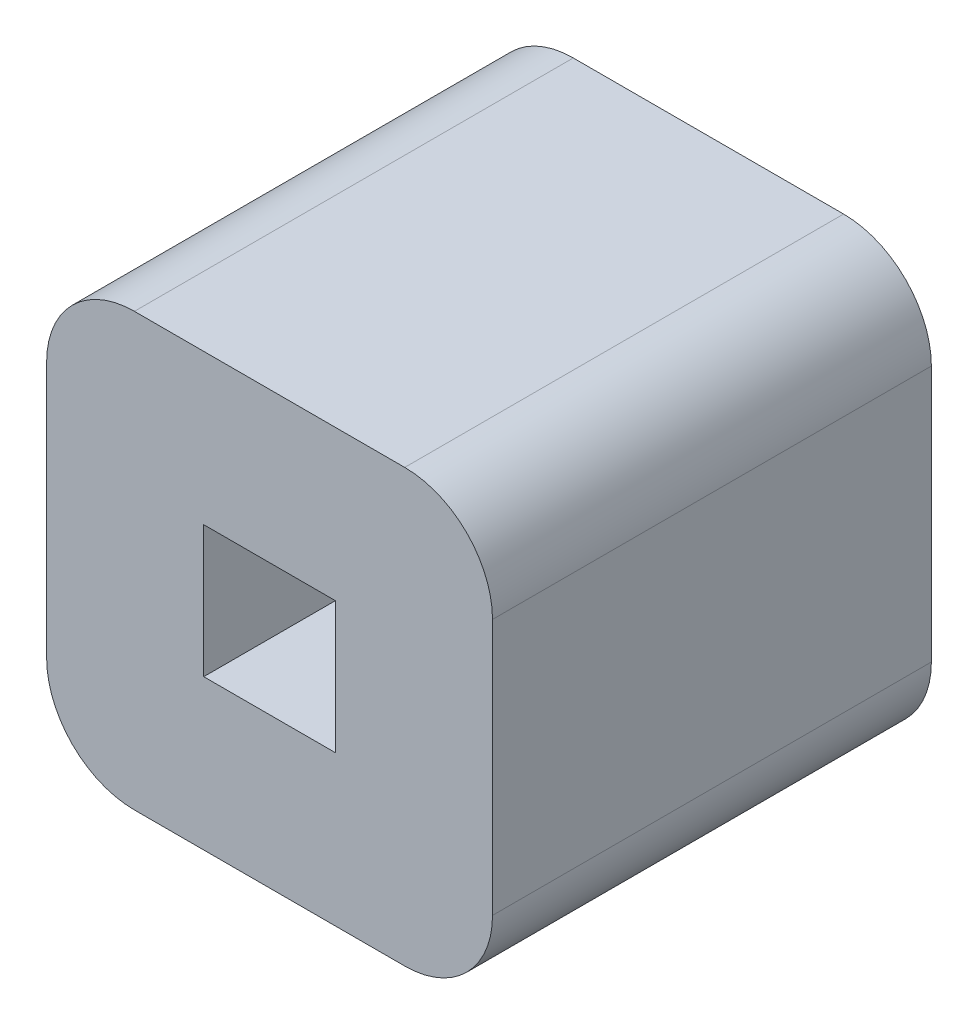
ISO-10303-21;
HEADER;
FILE_DESCRIPTION(('STEP AP214'),'2;1');
FILE_NAME('part.step','',(''),(''),'','','');
FILE_SCHEMA(('AUTOMOTIVE_DESIGN { 1 0 10303 214 1 1 1 1 }'));
ENDSEC;
DATA;
#1=APPLICATION_CONTEXT('core data for automotive mechanical design processes');
#2=APPLICATION_PROTOCOL_DEFINITION('international standard','automotive_design',2000,#1);
#3=PRODUCT_CONTEXT('',#1,'mechanical');
#4=PRODUCT('Part','Part','',(#3));
#5=PRODUCT_RELATED_PRODUCT_CATEGORY('part','',(#4));
#6=PRODUCT_DEFINITION_FORMATION('','',#4);
#7=PRODUCT_DEFINITION_CONTEXT('part definition',#1,'design');
#8=PRODUCT_DEFINITION('design','',#6,#7);
#9=PRODUCT_DEFINITION_SHAPE('','',#8);
#10=(LENGTH_UNIT() NAMED_UNIT(*) SI_UNIT(.MILLI.,.METRE.));
#11=(NAMED_UNIT(*) PLANE_ANGLE_UNIT() SI_UNIT($,.RADIAN.));
#12=(NAMED_UNIT(*) SI_UNIT($,.STERADIAN.) SOLID_ANGLE_UNIT());
#13=UNCERTAINTY_MEASURE_WITH_UNIT(LENGTH_MEASURE(1.E-05),#10,'distance_accuracy_value','');
#14=(GEOMETRIC_REPRESENTATION_CONTEXT(3) GLOBAL_UNCERTAINTY_ASSIGNED_CONTEXT((#13)) GLOBAL_UNIT_ASSIGNED_CONTEXT((#10,
#11,#12)) REPRESENTATION_CONTEXT('',''));
#15=CARTESIAN_POINT('',(0.,0.,0.));
#16=DIRECTION('',(0.,0.,1.));
#17=DIRECTION('',(1.,0.,0.));
#18=AXIS2_PLACEMENT_3D('',#15,#16,#17);
#19=CARTESIAN_POINT('',(0.960735714690616,-1.07588735959036,0.16337874015748));
#20=DIRECTION('',(0.,0.,1.));
#21=DIRECTION('',(0.,-1.,0.));
#22=AXIS2_PLACEMENT_3D('',#19,#20,#21);
#23=PLANE('',#22);
#24=DIRECTION('',(1.,0.,0.));
#25=VECTOR('',#24,1.);
#26=CARTESIAN_POINT('',(1.0823892579977,-0.869194446204529,0.16337874015748));
#27=LINE('',#26,#25);
#28=CARTESIAN_POINT('',(1.14605067532054,-0.869194446204529,0.16337874015748));
#29=VERTEX_POINT('',#28);
#30=CARTESIAN_POINT('',(1.08542075406069,-0.869194446204529,0.16337874015748));
#31=VERTEX_POINT('',#30);
#32=EDGE_CURVE('E131',#29,#31,#27,.F.);
#33=ORIENTED_EDGE('',*,*,#32,.T.);
#34=CARTESIAN_POINT('',(1.08542075406069,-0.888879485574608,0.16337874015748));
#35=DIRECTION('',(0.,0.,1.));
#36=DIRECTION('',(0.,-1.,0.));
#37=AXIS2_PLACEMENT_3D('',#34,#35,#36);
#38=CIRCLE('',#37,0.0196850393700787);
#39=CARTESIAN_POINT('',(1.06573571469062,-0.888879485574608,0.16337874015748));
#40=VERTEX_POINT('',#39);
#41=EDGE_CURVE('E134',#40,#31,#38,.F.);
#42=ORIENTED_EDGE('',*,*,#41,.F.);
#43=DIRECTION('',(0.,-1.,0.));
#44=VECTOR('',#43,1.);
#45=CARTESIAN_POINT('',(1.06573571469062,-0.917619643054922,0.16337874015748));
#46=LINE('',#45,#44);
#47=CARTESIAN_POINT('',(1.06573571469062,-0.946359800535237,0.16337874015748));
#48=VERTEX_POINT('',#47);
#49=EDGE_CURVE('E128',#48,#40,#46,.F.);
#50=ORIENTED_EDGE('',*,*,#49,.F.);
#51=CARTESIAN_POINT('',(1.08542075406069,-0.946359800535237,0.16337874015748));
#52=DIRECTION('',(0.,0.,-1.));
#53=DIRECTION('',(0.,1.,0.));
#54=AXIS2_PLACEMENT_3D('',#51,#52,#53);
#55=CIRCLE('',#54,0.0196850393700787);
#56=CARTESIAN_POINT('',(1.08542075406069,-0.966044839905316,0.16337874015748));
#57=VERTEX_POINT('',#56);
#58=EDGE_CURVE('E20',#57,#48,#55,.T.);
#59=ORIENTED_EDGE('',*,*,#58,.F.);
#60=DIRECTION('',(1.,0.,0.));
#61=VECTOR('',#60,1.);
#62=CARTESIAN_POINT('',(1.0823892579977,-0.966044839905316,0.16337874015748));
#63=LINE('',#62,#61);
#64=CARTESIAN_POINT('',(1.14605067532054,-0.966044839905316,0.16337874015748));
#65=VERTEX_POINT('',#64);
#66=EDGE_CURVE('E82',#65,#57,#63,.F.);
#67=ORIENTED_EDGE('',*,*,#66,.F.);
#68=CARTESIAN_POINT('',(1.14605067532054,-0.946359800535237,0.16337874015748));
#69=DIRECTION('',(0.,0.,-1.));
#70=DIRECTION('',(0.,1.,0.));
#71=AXIS2_PLACEMENT_3D('',#68,#69,#70);
#72=CIRCLE('',#71,0.0196850393700787);
#73=CARTESIAN_POINT('',(1.16573571469062,-0.946359800535237,0.16337874015748));
#74=VERTEX_POINT('',#73);
#75=EDGE_CURVE('E161',#74,#65,#72,.T.);
#76=ORIENTED_EDGE('',*,*,#75,.F.);
#77=DIRECTION('',(0.,-1.,0.));
#78=VECTOR('',#77,1.);
#79=CARTESIAN_POINT('',(1.16573571469062,-0.881005469826576,0.16337874015748));
#80=LINE('',#79,#78);
#81=CARTESIAN_POINT('',(1.16573571469062,-0.888879485574608,0.16337874015748));
#82=VERTEX_POINT('',#81);
#83=EDGE_CURVE('E136',#74,#82,#80,.F.);
#84=ORIENTED_EDGE('',*,*,#83,.T.);
#85=CARTESIAN_POINT('',(1.14605067532054,-0.888879485574608,0.16337874015748));
#86=DIRECTION('',(0.,0.,1.));
#87=DIRECTION('',(0.,-1.,0.));
#88=AXIS2_PLACEMENT_3D('',#85,#86,#87);
#89=CIRCLE('',#88,0.0196850393700787);
#90=EDGE_CURVE('E139',#29,#82,#89,.F.);
#91=ORIENTED_EDGE('',*,*,#90,.F.);
#92=EDGE_LOOP('',(#33,#42,#50,#59,#67,#76,#84,#91));
#93=FACE_BOUND('',#92,.T.);
#94=DIRECTION('',(1.,0.,0.));
#95=VECTOR('',#94,1.);
#96=CARTESIAN_POINT('',(1.13197587217093,-0.902855863527363,0.16337874015748));
#97=LINE('',#96,#95);
#98=CARTESIAN_POINT('',(1.10097193516306,-0.902855863527363,0.16337874015748));
#99=VERTEX_POINT('',#98);
#100=CARTESIAN_POINT('',(1.13049949421818,-0.902855863527363,0.16337874015748));
#101=VERTEX_POINT('',#100);
#102=EDGE_CURVE('E104',#99,#101,#97,.T.);
#103=ORIENTED_EDGE('',*,*,#102,.T.);
#104=DIRECTION('',(0.,1.,0.));
#105=VECTOR('',#104,1.);
#106=CARTESIAN_POINT('',(1.13049949421818,-0.933859800535237,0.16337874015748));
#107=LINE('',#106,#105);
#108=CARTESIAN_POINT('',(1.13049949421818,-0.932383422582481,0.16337874015748));
#109=VERTEX_POINT('',#108);
#110=EDGE_CURVE('E177',#101,#109,#107,.F.);
#111=ORIENTED_EDGE('',*,*,#110,.T.);
#112=DIRECTION('',(1.,0.,0.));
#113=VECTOR('',#112,1.);
#114=CARTESIAN_POINT('',(1.13197587217093,-0.932383422582481,0.16337874015748));
#115=LINE('',#114,#113);
#116=CARTESIAN_POINT('',(1.10097193516306,-0.932383422582481,0.16337874015748));
#117=VERTEX_POINT('',#116);
#118=EDGE_CURVE('E91',#117,#109,#115,.T.);
#119=ORIENTED_EDGE('',*,*,#118,.F.);
#120=DIRECTION('',(0.,-1.,0.));
#121=VECTOR('',#120,1.);
#122=CARTESIAN_POINT('',(1.10097193516306,-0.901379485574607,0.16337874015748));
#123=LINE('',#122,#121);
#124=EDGE_CURVE('E102',#117,#99,#123,.F.);
#125=ORIENTED_EDGE('',*,*,#124,.T.);
#126=EDGE_LOOP('',(#103,#111,#119,#125));
#127=FACE_BOUND('',#126,.T.);
#128=ADVANCED_FACE('F17',(#93,#127),#23,.T.);
#129=CARTESIAN_POINT('',(1.10097193516306,-0.901379485574607,0.152158267716535));
#130=DIRECTION('',(-1.,0.,0.));
#131=DIRECTION('',(0.,-1.,0.));
#132=AXIS2_PLACEMENT_3D('',#129,#130,#131);
#133=PLANE('',#132);
#134=DIRECTION('',(0.,0.,1.));
#135=VECTOR('',#134,1.);
#136=CARTESIAN_POINT('',(1.10097193516306,-0.932383422582481,0.152158267716535));
#137=LINE('',#136,#135);
#138=CARTESIAN_POINT('',(1.10097193516306,-0.932383422582481,0.0649535433070866));
#139=VERTEX_POINT('',#138);
#140=EDGE_CURVE('E172',#139,#117,#137,.T.);
#141=ORIENTED_EDGE('',*,*,#140,.F.);
#142=DIRECTION('',(0.,-1.,0.));
#143=VECTOR('',#142,1.);
#144=CARTESIAN_POINT('',(1.10097193516306,-1.07588735959036,0.0649535433070866));
#145=LINE('',#144,#143);
#146=CARTESIAN_POINT('',(1.10097193516306,-0.902855863527363,0.0649535433070866));
#147=VERTEX_POINT('',#146);
#148=EDGE_CURVE('E124',#139,#147,#145,.F.);
#149=ORIENTED_EDGE('',*,*,#148,.T.);
#150=DIRECTION('',(0.,0.,1.));
#151=VECTOR('',#150,1.);
#152=CARTESIAN_POINT('',(1.10097193516306,-0.902855863527363,0.152158267716535));
#153=LINE('',#152,#151);
#154=EDGE_CURVE('E109',#147,#99,#153,.T.);
#155=ORIENTED_EDGE('',*,*,#154,.T.);
#156=ORIENTED_EDGE('',*,*,#124,.F.);
#157=EDGE_LOOP('',(#141,#149,#155,#156));
#158=FACE_BOUND('',#157,.T.);
#159=ADVANCED_FACE('F122',(#158),#133,.F.);
#160=CARTESIAN_POINT('',(1.13197587217093,-0.902855863527363,0.152158267716535));
#161=DIRECTION('',(0.,1.,0.));
#162=DIRECTION('',(0.,0.,1.));
#163=AXIS2_PLACEMENT_3D('',#160,#161,#162);
#164=PLANE('',#163);
#165=ORIENTED_EDGE('',*,*,#154,.F.);
#166=DIRECTION('',(1.,0.,0.));
#167=VECTOR('',#166,1.);
#168=CARTESIAN_POINT('',(0.960735714690616,-0.902855863527363,0.0649535433070866));
#169=LINE('',#168,#167);
#170=CARTESIAN_POINT('',(1.13049949421818,-0.902855863527363,0.0649535433070866));
#171=VERTEX_POINT('',#170);
#172=EDGE_CURVE('E193',#147,#171,#169,.T.);
#173=ORIENTED_EDGE('',*,*,#172,.T.);
#174=DIRECTION('',(0.,0.,1.));
#175=VECTOR('',#174,1.);
#176=CARTESIAN_POINT('',(1.13049949421818,-0.902855863527363,0.152158267716535));
#177=LINE('',#176,#175);
#178=EDGE_CURVE('E119',#171,#101,#177,.T.);
#179=ORIENTED_EDGE('',*,*,#178,.T.);
#180=ORIENTED_EDGE('',*,*,#102,.F.);
#181=EDGE_LOOP('',(#165,#173,#179,#180));
#182=FACE_BOUND('',#181,.T.);
#183=ADVANCED_FACE('F114',(#182),#164,.F.);
#184=CARTESIAN_POINT('',(1.13049949421818,-0.933859800535237,0.152158267716535));
#185=DIRECTION('',(1.,0.,0.));
#186=DIRECTION('',(0.,1.,0.));
#187=AXIS2_PLACEMENT_3D('',#184,#185,#186);
#188=PLANE('',#187);
#189=ORIENTED_EDGE('',*,*,#178,.F.);
#190=DIRECTION('',(0.,-1.,0.));
#191=VECTOR('',#190,1.);
#192=CARTESIAN_POINT('',(1.13049949421818,-1.07588735959036,0.0649535433070866));
#193=LINE('',#192,#191);
#194=CARTESIAN_POINT('',(1.13049949421818,-0.932383422582481,0.0649535433070866));
#195=VERTEX_POINT('',#194);
#196=EDGE_CURVE('E183',#171,#195,#193,.T.);
#197=ORIENTED_EDGE('',*,*,#196,.T.);
#198=DIRECTION('',(0.,0.,1.));
#199=VECTOR('',#198,1.);
#200=CARTESIAN_POINT('',(1.13049949421818,-0.932383422582481,0.152158267716535));
#201=LINE('',#200,#199);
#202=EDGE_CURVE('E174',#109,#195,#201,.F.);
#203=ORIENTED_EDGE('',*,*,#202,.F.);
#204=ORIENTED_EDGE('',*,*,#110,.F.);
#205=EDGE_LOOP('',(#189,#197,#203,#204));
#206=FACE_BOUND('',#205,.T.);
#207=ADVANCED_FACE('F181',(#206),#188,.F.);
#208=CARTESIAN_POINT('',(1.13197587217093,-0.932383422582481,0.152158267716535));
#209=DIRECTION('',(0.,1.,0.));
#210=DIRECTION('',(0.,0.,1.));
#211=AXIS2_PLACEMENT_3D('',#208,#209,#210);
#212=PLANE('',#211);
#213=DIRECTION('',(1.,0.,0.));
#214=VECTOR('',#213,1.);
#215=CARTESIAN_POINT('',(0.960735714690616,-0.932383422582481,0.0649535433070866));
#216=LINE('',#215,#214);
#217=EDGE_CURVE('E157',#195,#139,#216,.F.);
#218=ORIENTED_EDGE('',*,*,#217,.T.);
#219=ORIENTED_EDGE('',*,*,#140,.T.);
#220=ORIENTED_EDGE('',*,*,#118,.T.);
#221=ORIENTED_EDGE('',*,*,#202,.T.);
#222=EDGE_LOOP('',(#218,#219,#220,#221));
#223=FACE_BOUND('',#222,.T.);
#224=ADVANCED_FACE('F186',(#223),#212,.T.);
#225=CARTESIAN_POINT('',(1.08542075406069,-0.946359800535237,0.1683));
#226=DIRECTION('',(0.,0.,-1.));
#227=DIRECTION('',(0.,1.,0.));
#228=AXIS2_PLACEMENT_3D('',#225,#226,#227);
#229=CYLINDRICAL_SURFACE('',#228,0.0196850393700787);
#230=ORIENTED_EDGE('',*,*,#58,.T.);
#231=DIRECTION('',(0.,0.,1.));
#232=VECTOR('',#231,1.);
#233=CARTESIAN_POINT('',(1.06573571469062,-0.946359800535237,0.114166141732283));
#234=LINE('',#233,#232);
#235=CARTESIAN_POINT('',(1.06573571469062,-0.946359800535237,0.0649535433070866));
#236=VERTEX_POINT('',#235);
#237=EDGE_CURVE('E130',#236,#48,#234,.T.);
#238=ORIENTED_EDGE('',*,*,#237,.F.);
#239=CARTESIAN_POINT('',(1.08542075406069,-0.946359800535237,0.0649535433070866));
#240=DIRECTION('',(0.,0.,-1.));
#241=DIRECTION('',(0.,1.,0.));
#242=AXIS2_PLACEMENT_3D('',#239,#240,#241);
#243=CIRCLE('',#242,0.0196850393700787);
#244=CARTESIAN_POINT('',(1.08542075406069,-0.966044839905316,0.0649535433070866));
#245=VERTEX_POINT('',#244);
#246=EDGE_CURVE('E154',#236,#245,#243,.F.);
#247=ORIENTED_EDGE('',*,*,#246,.T.);
#248=DIRECTION('',(0.,0.,-1.));
#249=VECTOR('',#248,1.);
#250=CARTESIAN_POINT('',(1.08542075406069,-0.966044839905316,0.0600322834645669));
#251=LINE('',#250,#249);
#252=EDGE_CURVE('E142',#57,#245,#251,.T.);
#253=ORIENTED_EDGE('',*,*,#252,.F.);
#254=EDGE_LOOP('',(#230,#238,#247,#253));
#255=FACE_BOUND('',#254,.T.);
#256=ADVANCED_FACE('F232',(#255),#229,.T.);
#257=CARTESIAN_POINT('',(1.0823892579977,-0.966044839905316,0.0600322834645669));
#258=DIRECTION('',(0.,-1.,0.));
#259=DIRECTION('',(0.,0.,-1.));
#260=AXIS2_PLACEMENT_3D('',#257,#258,#259);
#261=PLANE('',#260);
#262=ORIENTED_EDGE('',*,*,#66,.T.);
#263=ORIENTED_EDGE('',*,*,#252,.T.);
#264=DIRECTION('',(1.,0.,0.));
#265=VECTOR('',#264,1.);
#266=CARTESIAN_POINT('',(0.960735714690616,-0.966044839905316,0.0649535433070866));
#267=LINE('',#266,#265);
#268=CARTESIAN_POINT('',(1.14605067532054,-0.966044839905316,0.0649535433070866));
#269=VERTEX_POINT('',#268);
#270=EDGE_CURVE('E153',#245,#269,#267,.T.);
#271=ORIENTED_EDGE('',*,*,#270,.T.);
#272=DIRECTION('',(0.,0.,-1.));
#273=VECTOR('',#272,1.);
#274=CARTESIAN_POINT('',(1.14605067532054,-0.966044839905316,0.1683));
#275=LINE('',#274,#273);
#276=EDGE_CURVE('E162',#65,#269,#275,.T.);
#277=ORIENTED_EDGE('',*,*,#276,.F.);
#278=EDGE_LOOP('',(#262,#263,#271,#277));
#279=FACE_BOUND('',#278,.T.);
#280=ADVANCED_FACE('F229',(#279),#261,.T.);
#281=CARTESIAN_POINT('',(1.14605067532054,-0.946359800535237,0.1683));
#282=DIRECTION('',(0.,0.,-1.));
#283=DIRECTION('',(0.,1.,0.));
#284=AXIS2_PLACEMENT_3D('',#281,#282,#283);
#285=CYLINDRICAL_SURFACE('',#284,0.0196850393700787);
#286=ORIENTED_EDGE('',*,*,#75,.T.);
#287=ORIENTED_EDGE('',*,*,#276,.T.);
#288=CARTESIAN_POINT('',(1.14605067532054,-0.946359800535237,0.0649535433070866));
#289=DIRECTION('',(0.,0.,-1.));
#290=DIRECTION('',(0.,1.,0.));
#291=AXIS2_PLACEMENT_3D('',#288,#289,#290);
#292=CIRCLE('',#291,0.0196850393700787);
#293=CARTESIAN_POINT('',(1.16573571469062,-0.946359800535237,0.0649535433070866));
#294=VERTEX_POINT('',#293);
#295=EDGE_CURVE('E150',#269,#294,#292,.F.);
#296=ORIENTED_EDGE('',*,*,#295,.T.);
#297=DIRECTION('',(0.,0.,1.));
#298=VECTOR('',#297,1.);
#299=CARTESIAN_POINT('',(1.16573571469062,-0.946359800535237,0.0600322834645669));
#300=LINE('',#299,#298);
#301=EDGE_CURVE('E140',#294,#74,#300,.T.);
#302=ORIENTED_EDGE('',*,*,#301,.T.);
#303=EDGE_LOOP('',(#286,#287,#296,#302));
#304=FACE_BOUND('',#303,.T.);
#305=ADVANCED_FACE('F206',(#304),#285,.T.);
#306=CARTESIAN_POINT('',(1.16573571469062,-0.881005469826576,0.0600322834645669));
#307=DIRECTION('',(-1.,0.,0.));
#308=DIRECTION('',(0.,-1.,0.));
#309=AXIS2_PLACEMENT_3D('',#306,#307,#308);
#310=PLANE('',#309);
#311=ORIENTED_EDGE('',*,*,#301,.F.);
#312=DIRECTION('',(0.,-1.,0.));
#313=VECTOR('',#312,1.);
#314=CARTESIAN_POINT('',(1.16573571469062,-1.07588735959036,0.0649535433070866));
#315=LINE('',#314,#313);
#316=CARTESIAN_POINT('',(1.16573571469062,-0.888879485574608,0.0649535433070866));
#317=VERTEX_POINT('',#316);
#318=EDGE_CURVE('E149',#294,#317,#315,.F.);
#319=ORIENTED_EDGE('',*,*,#318,.T.);
#320=DIRECTION('',(0.,0.,1.));
#321=VECTOR('',#320,1.);
#322=CARTESIAN_POINT('',(1.16573571469062,-0.888879485574608,0.1683));
#323=LINE('',#322,#321);
#324=EDGE_CURVE('E160',#82,#317,#323,.F.);
#325=ORIENTED_EDGE('',*,*,#324,.F.);
#326=ORIENTED_EDGE('',*,*,#83,.F.);
#327=EDGE_LOOP('',(#311,#319,#325,#326));
#328=FACE_BOUND('',#327,.T.);
#329=ADVANCED_FACE('F212',(#328),#310,.F.);
#330=CARTESIAN_POINT('',(1.14605067532054,-0.888879485574608,0.1683));
#331=DIRECTION('',(0.,0.,1.));
#332=DIRECTION('',(0.,-1.,0.));
#333=AXIS2_PLACEMENT_3D('',#330,#331,#332);
#334=CYLINDRICAL_SURFACE('',#333,0.0196850393700787);
#335=ORIENTED_EDGE('',*,*,#90,.T.);
#336=ORIENTED_EDGE('',*,*,#324,.T.);
#337=CARTESIAN_POINT('',(1.14605067532054,-0.888879485574608,0.0649535433070866));
#338=DIRECTION('',(0.,0.,1.));
#339=DIRECTION('',(0.,-1.,0.));
#340=AXIS2_PLACEMENT_3D('',#337,#338,#339);
#341=CIRCLE('',#340,0.0196850393700787);
#342=CARTESIAN_POINT('',(1.14605067532054,-0.869194446204529,0.0649535433070866));
#343=VERTEX_POINT('',#342);
#344=EDGE_CURVE('E146',#317,#343,#341,.T.);
#345=ORIENTED_EDGE('',*,*,#344,.T.);
#346=DIRECTION('',(0.,0.,-1.));
#347=VECTOR('',#346,1.);
#348=CARTESIAN_POINT('',(1.14605067532054,-0.869194446204529,0.0600322834645669));
#349=LINE('',#348,#347);
#350=EDGE_CURVE('E135',#343,#29,#349,.F.);
#351=ORIENTED_EDGE('',*,*,#350,.T.);
#352=EDGE_LOOP('',(#335,#336,#345,#351));
#353=FACE_BOUND('',#352,.T.);
#354=ADVANCED_FACE('F225',(#353),#334,.T.);
#355=CARTESIAN_POINT('',(1.0823892579977,-0.869194446204529,0.0600322834645669));
#356=DIRECTION('',(0.,-1.,0.));
#357=DIRECTION('',(0.,0.,-1.));
#358=AXIS2_PLACEMENT_3D('',#355,#356,#357);
#359=PLANE('',#358);
#360=DIRECTION('',(0.,0.,1.));
#361=VECTOR('',#360,1.);
#362=CARTESIAN_POINT('',(1.08542075406069,-0.869194446204529,0.1683));
#363=LINE('',#362,#361);
#364=CARTESIAN_POINT('',(1.08542075406069,-0.869194446204529,0.0649535433070866));
#365=VERTEX_POINT('',#364);
#366=EDGE_CURVE('E159',#31,#365,#363,.F.);
#367=ORIENTED_EDGE('',*,*,#366,.F.);
#368=ORIENTED_EDGE('',*,*,#32,.F.);
#369=ORIENTED_EDGE('',*,*,#350,.F.);
#370=DIRECTION('',(1.,0.,0.));
#371=VECTOR('',#370,1.);
#372=CARTESIAN_POINT('',(0.960735714690616,-0.869194446204529,0.0649535433070866));
#373=LINE('',#372,#371);
#374=EDGE_CURVE('E145',#343,#365,#373,.F.);
#375=ORIENTED_EDGE('',*,*,#374,.T.);
#376=EDGE_LOOP('',(#367,#368,#369,#375));
#377=FACE_BOUND('',#376,.T.);
#378=ADVANCED_FACE('F222',(#377),#359,.F.);
#379=CARTESIAN_POINT('',(1.08542075406069,-0.888879485574608,0.1683));
#380=DIRECTION('',(0.,0.,1.));
#381=DIRECTION('',(0.,-1.,0.));
#382=AXIS2_PLACEMENT_3D('',#379,#380,#381);
#383=CYLINDRICAL_SURFACE('',#382,0.0196850393700787);
#384=ORIENTED_EDGE('',*,*,#41,.T.);
#385=ORIENTED_EDGE('',*,*,#366,.T.);
#386=CARTESIAN_POINT('',(1.08542075406069,-0.888879485574608,0.0649535433070866));
#387=DIRECTION('',(0.,0.,1.));
#388=DIRECTION('',(0.,-1.,0.));
#389=AXIS2_PLACEMENT_3D('',#386,#387,#388);
#390=CIRCLE('',#389,0.0196850393700787);
#391=CARTESIAN_POINT('',(1.06573571469062,-0.888879485574608,0.0649535433070866));
#392=VERTEX_POINT('',#391);
#393=EDGE_CURVE('E26',#365,#392,#390,.T.);
#394=ORIENTED_EDGE('',*,*,#393,.T.);
#395=DIRECTION('',(0.,0.,1.));
#396=VECTOR('',#395,1.);
#397=CARTESIAN_POINT('',(1.06573571469062,-0.888879485574608,0.114166141732283));
#398=LINE('',#397,#396);
#399=EDGE_CURVE('E34',#40,#392,#398,.F.);
#400=ORIENTED_EDGE('',*,*,#399,.F.);
#401=EDGE_LOOP('',(#384,#385,#394,#400));
#402=FACE_BOUND('',#401,.T.);
#403=ADVANCED_FACE('F235',(#402),#383,.T.);
#404=CARTESIAN_POINT('',(1.06573571469062,-0.917619643054922,0.114166141732283));
#405=DIRECTION('',(-1.,0.,0.));
#406=DIRECTION('',(0.,-1.,0.));
#407=AXIS2_PLACEMENT_3D('',#404,#405,#406);
#408=PLANE('',#407);
#409=ORIENTED_EDGE('',*,*,#237,.T.);
#410=ORIENTED_EDGE('',*,*,#49,.T.);
#411=ORIENTED_EDGE('',*,*,#399,.T.);
#412=DIRECTION('',(0.,-1.,0.));
#413=VECTOR('',#412,1.);
#414=CARTESIAN_POINT('',(1.06573571469062,-1.07588735959036,0.0649535433070866));
#415=LINE('',#414,#413);
#416=EDGE_CURVE('E11',#392,#236,#415,.T.);
#417=ORIENTED_EDGE('',*,*,#416,.T.);
#418=EDGE_LOOP('',(#409,#410,#411,#417));
#419=FACE_BOUND('',#418,.T.);
#420=ADVANCED_FACE('F233',(#419),#408,.T.);
#421=CARTESIAN_POINT('',(0.960735714690616,-1.07588735959036,0.0649535433070866));
#422=DIRECTION('',(0.,0.,1.));
#423=DIRECTION('',(0.,-1.,0.));
#424=AXIS2_PLACEMENT_3D('',#421,#422,#423);
#425=PLANE('',#424);
#426=ORIENTED_EDGE('',*,*,#393,.F.);
#427=ORIENTED_EDGE('',*,*,#374,.F.);
#428=ORIENTED_EDGE('',*,*,#344,.F.);
#429=ORIENTED_EDGE('',*,*,#318,.F.);
#430=ORIENTED_EDGE('',*,*,#295,.F.);
#431=ORIENTED_EDGE('',*,*,#270,.F.);
#432=ORIENTED_EDGE('',*,*,#246,.F.);
#433=ORIENTED_EDGE('',*,*,#416,.F.);
#434=EDGE_LOOP('',(#426,#427,#428,#429,#430,#431,#432,#433));
#435=FACE_BOUND('',#434,.T.);
#436=ORIENTED_EDGE('',*,*,#196,.F.);
#437=ORIENTED_EDGE('',*,*,#172,.F.);
#438=ORIENTED_EDGE('',*,*,#148,.F.);
#439=ORIENTED_EDGE('',*,*,#217,.F.);
#440=EDGE_LOOP('',(#436,#437,#438,#439));
#441=FACE_BOUND('',#440,.T.);
#442=ADVANCED_FACE('F191',(#435,#441),#425,.F.);
#443=CLOSED_SHELL('',(#128,#159,#183,#207,#224,#256,#280,#305,#329,#354,#378,#403,#420,#442));
#444=MANIFOLD_SOLID_BREP('B1',#443);
#445=ADVANCED_BREP_SHAPE_REPRESENTATION('',(#18,#444),#14);
#446=SHAPE_DEFINITION_REPRESENTATION(#9,#445);
ENDSEC;
END-ISO-10303-21;
